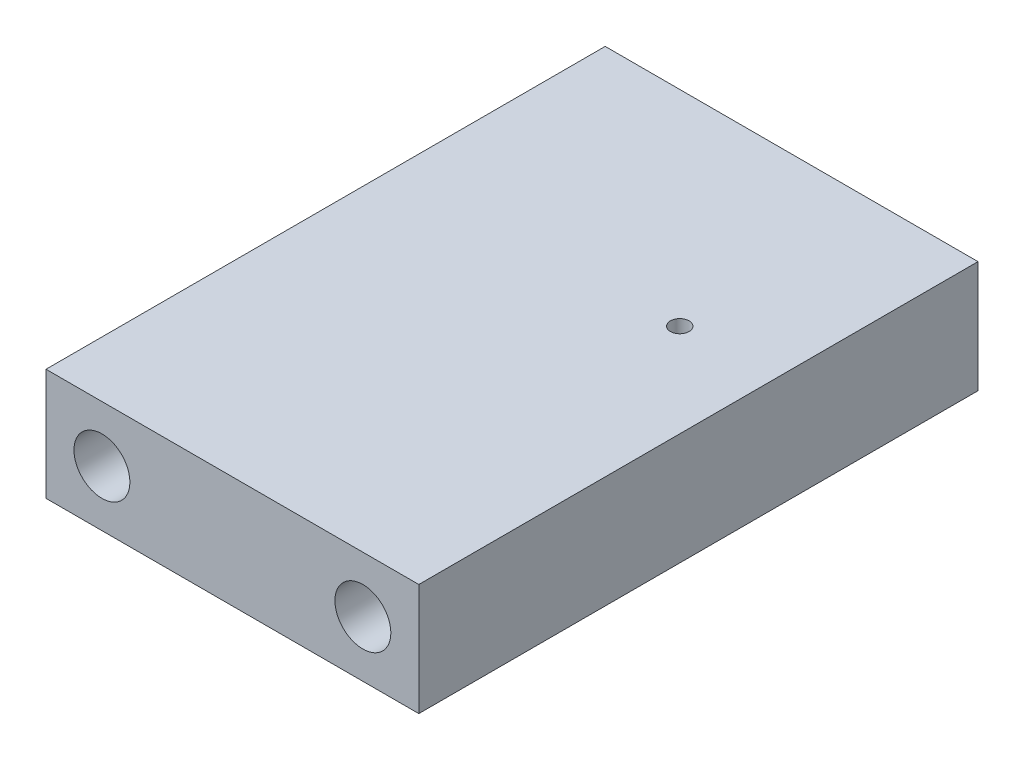
ISO-10303-21;
HEADER;
FILE_DESCRIPTION(('STEP AP214'),'2;1');
FILE_NAME('part.step','',(''),(''),'','','');
FILE_SCHEMA(('AUTOMOTIVE_DESIGN { 1 0 10303 214 1 1 1 1 }'));
ENDSEC;
DATA;
#1=APPLICATION_CONTEXT('core data for automotive mechanical design processes');
#2=APPLICATION_PROTOCOL_DEFINITION('international standard','automotive_design',2000,#1);
#3=PRODUCT_CONTEXT('',#1,'mechanical');
#4=PRODUCT('Part','Part','',(#3));
#5=PRODUCT_RELATED_PRODUCT_CATEGORY('part','',(#4));
#6=PRODUCT_DEFINITION_FORMATION('','',#4);
#7=PRODUCT_DEFINITION_CONTEXT('part definition',#1,'design');
#8=PRODUCT_DEFINITION('design','',#6,#7);
#9=PRODUCT_DEFINITION_SHAPE('','',#8);
#10=(LENGTH_UNIT() NAMED_UNIT(*) SI_UNIT(.MILLI.,.METRE.));
#11=(NAMED_UNIT(*) PLANE_ANGLE_UNIT() SI_UNIT($,.RADIAN.));
#12=(NAMED_UNIT(*) SI_UNIT($,.STERADIAN.) SOLID_ANGLE_UNIT());
#13=UNCERTAINTY_MEASURE_WITH_UNIT(LENGTH_MEASURE(1.E-05),#10,'distance_accuracy_value','');
#14=(GEOMETRIC_REPRESENTATION_CONTEXT(3) GLOBAL_UNCERTAINTY_ASSIGNED_CONTEXT((#13)) GLOBAL_UNIT_ASSIGNED_CONTEXT((#10,
#11,#12)) REPRESENTATION_CONTEXT('',''));
#15=CARTESIAN_POINT('',(0.,0.,0.));
#16=DIRECTION('',(0.,0.,1.));
#17=DIRECTION('',(1.,0.,0.));
#18=AXIS2_PLACEMENT_3D('',#15,#16,#17);
#19=CARTESIAN_POINT('',(0.,0.,30.));
#20=DIRECTION('',(1.,0.,0.));
#21=DIRECTION('',(0.,0.,-1.));
#22=AXIS2_PLACEMENT_3D('',#19,#20,#21);
#23=PLANE('',#22);
#24=DIRECTION('',(0.,-1.,0.));
#25=VECTOR('',#24,1.);
#26=CARTESIAN_POINT('',(0.,0.,0.));
#27=LINE('',#26,#25);
#28=CARTESIAN_POINT('',(0.,6.,0.));
#29=VERTEX_POINT('',#28);
#30=CARTESIAN_POINT('',(0.,0.,0.));
#31=VERTEX_POINT('',#30);
#32=EDGE_CURVE('E95',#29,#31,#27,.T.);
#33=ORIENTED_EDGE('',*,*,#32,.T.);
#34=DIRECTION('',(0.,0.,-1.));
#35=VECTOR('',#34,1.);
#36=CARTESIAN_POINT('',(0.,0.,30.));
#37=LINE('',#36,#35);
#38=CARTESIAN_POINT('',(0.,0.,30.));
#39=VERTEX_POINT('',#38);
#40=EDGE_CURVE('E11',#39,#31,#37,.T.);
#41=ORIENTED_EDGE('',*,*,#40,.F.);
#42=DIRECTION('',(0.,-1.,0.));
#43=VECTOR('',#42,1.);
#44=CARTESIAN_POINT('',(0.,0.,30.));
#45=LINE('',#44,#43);
#46=CARTESIAN_POINT('',(0.,6.,30.));
#47=VERTEX_POINT('',#46);
#48=EDGE_CURVE('E83',#47,#39,#45,.T.);
#49=ORIENTED_EDGE('',*,*,#48,.F.);
#50=DIRECTION('',(0.,0.,-1.));
#51=VECTOR('',#50,1.);
#52=CARTESIAN_POINT('',(0.,6.,30.));
#53=LINE('',#52,#51);
#54=EDGE_CURVE('E91',#47,#29,#53,.T.);
#55=ORIENTED_EDGE('',*,*,#54,.T.);
#56=EDGE_LOOP('',(#33,#41,#49,#55));
#57=FACE_BOUND('',#56,.T.);
#58=ADVANCED_FACE('F32',(#57),#23,.F.);
#59=CARTESIAN_POINT('',(0.,0.,30.));
#60=DIRECTION('',(0.,1.,0.));
#61=DIRECTION('',(0.,0.,1.));
#62=AXIS2_PLACEMENT_3D('',#59,#60,#61);
#63=PLANE('',#62);
#64=CARTESIAN_POINT('',(15.,0.,11.));
#65=DIRECTION('',(0.,1.,0.));
#66=DIRECTION('',(0.,0.,1.));
#67=AXIS2_PLACEMENT_3D('',#64,#65,#66);
#68=CIRCLE('',#67,0.500000000000001);
#69=CARTESIAN_POINT('',(15.,0.,11.5));
#70=VERTEX_POINT('',#69);
#71=EDGE_CURVE('E130',#70,#70,#68,.T.);
#72=ORIENTED_EDGE('',*,*,#71,.T.);
#73=EDGE_LOOP('',(#72));
#74=FACE_BOUND('',#73,.T.);
#75=DIRECTION('',(1.,0.,0.));
#76=VECTOR('',#75,1.);
#77=CARTESIAN_POINT('',(0.,0.,0.));
#78=LINE('',#77,#76);
#79=CARTESIAN_POINT('',(20.,0.,0.));
#80=VERTEX_POINT('',#79);
#81=EDGE_CURVE('E87',#31,#80,#78,.T.);
#82=ORIENTED_EDGE('',*,*,#81,.T.);
#83=DIRECTION('',(0.,0.,-1.));
#84=VECTOR('',#83,1.);
#85=CARTESIAN_POINT('',(20.,0.,30.));
#86=LINE('',#85,#84);
#87=CARTESIAN_POINT('',(20.,0.,30.));
#88=VERTEX_POINT('',#87);
#89=EDGE_CURVE('E40',#88,#80,#86,.T.);
#90=ORIENTED_EDGE('',*,*,#89,.F.);
#91=DIRECTION('',(1.,0.,0.));
#92=VECTOR('',#91,1.);
#93=CARTESIAN_POINT('',(0.,0.,30.));
#94=LINE('',#93,#92);
#95=EDGE_CURVE('E78',#39,#88,#94,.T.);
#96=ORIENTED_EDGE('',*,*,#95,.F.);
#97=ORIENTED_EDGE('',*,*,#40,.T.);
#98=EDGE_LOOP('',(#82,#90,#96,#97));
#99=FACE_BOUND('',#98,.T.);
#100=ADVANCED_FACE('F86',(#74,#99),#63,.F.);
#101=CARTESIAN_POINT('',(20.,0.,30.));
#102=DIRECTION('',(-1.,0.,0.));
#103=DIRECTION('',(0.,0.,1.));
#104=AXIS2_PLACEMENT_3D('',#101,#102,#103);
#105=PLANE('',#104);
#106=DIRECTION('',(0.,1.,0.));
#107=VECTOR('',#106,1.);
#108=CARTESIAN_POINT('',(20.,0.,0.));
#109=LINE('',#108,#107);
#110=CARTESIAN_POINT('',(20.,6.,0.));
#111=VERTEX_POINT('',#110);
#112=EDGE_CURVE('E65',#80,#111,#109,.T.);
#113=ORIENTED_EDGE('',*,*,#112,.T.);
#114=DIRECTION('',(0.,0.,-1.));
#115=VECTOR('',#114,1.);
#116=CARTESIAN_POINT('',(20.,6.,30.));
#117=LINE('',#116,#115);
#118=CARTESIAN_POINT('',(20.,6.,30.));
#119=VERTEX_POINT('',#118);
#120=EDGE_CURVE('E88',#119,#111,#117,.T.);
#121=ORIENTED_EDGE('',*,*,#120,.F.);
#122=DIRECTION('',(0.,1.,0.));
#123=VECTOR('',#122,1.);
#124=CARTESIAN_POINT('',(20.,0.,30.));
#125=LINE('',#124,#123);
#126=EDGE_CURVE('E81',#88,#119,#125,.T.);
#127=ORIENTED_EDGE('',*,*,#126,.F.);
#128=ORIENTED_EDGE('',*,*,#89,.T.);
#129=EDGE_LOOP('',(#113,#121,#127,#128));
#130=FACE_BOUND('',#129,.T.);
#131=ADVANCED_FACE('F89',(#130),#105,.F.);
#132=CARTESIAN_POINT('',(0.,6.,30.));
#133=DIRECTION('',(0.,-1.,0.));
#134=DIRECTION('',(0.,0.,-1.));
#135=AXIS2_PLACEMENT_3D('',#132,#133,#134);
#136=PLANE('',#135);
#137=CARTESIAN_POINT('',(15.,6.,11.));
#138=DIRECTION('',(0.,1.,0.));
#139=DIRECTION('',(0.,0.,1.));
#140=AXIS2_PLACEMENT_3D('',#137,#138,#139);
#141=CIRCLE('',#140,0.500000000000001);
#142=CARTESIAN_POINT('',(15.,6.,11.5));
#143=VERTEX_POINT('',#142);
#144=EDGE_CURVE('E135',#143,#143,#141,.T.);
#145=ORIENTED_EDGE('',*,*,#144,.F.);
#146=EDGE_LOOP('',(#145));
#147=FACE_BOUND('',#146,.T.);
#148=DIRECTION('',(-1.,0.,0.));
#149=VECTOR('',#148,1.);
#150=CARTESIAN_POINT('',(0.,6.,0.));
#151=LINE('',#150,#149);
#152=EDGE_CURVE('E71',#111,#29,#151,.T.);
#153=ORIENTED_EDGE('',*,*,#152,.T.);
#154=ORIENTED_EDGE('',*,*,#54,.F.);
#155=DIRECTION('',(-1.,0.,0.));
#156=VECTOR('',#155,1.);
#157=CARTESIAN_POINT('',(0.,6.,30.));
#158=LINE('',#157,#156);
#159=EDGE_CURVE('E48',#119,#47,#158,.T.);
#160=ORIENTED_EDGE('',*,*,#159,.F.);
#161=ORIENTED_EDGE('',*,*,#120,.T.);
#162=EDGE_LOOP('',(#153,#154,#160,#161));
#163=FACE_BOUND('',#162,.T.);
#164=ADVANCED_FACE('F103',(#147,#163),#136,.F.);
#165=CARTESIAN_POINT('',(0.,0.,30.));
#166=DIRECTION('',(0.,0.,-1.));
#167=DIRECTION('',(-1.,0.,0.));
#168=AXIS2_PLACEMENT_3D('',#165,#166,#167);
#169=PLANE('',#168);
#170=CARTESIAN_POINT('',(17.,3.,30.));
#171=DIRECTION('',(0.,0.,1.));
#172=DIRECTION('',(1.,0.,0.));
#173=AXIS2_PLACEMENT_3D('',#170,#171,#172);
#174=CIRCLE('',#173,1.5);
#175=CARTESIAN_POINT('',(18.5,3.,30.));
#176=VERTEX_POINT('',#175);
#177=EDGE_CURVE('E115',#176,#176,#174,.T.);
#178=ORIENTED_EDGE('',*,*,#177,.F.);
#179=EDGE_LOOP('',(#178));
#180=FACE_BOUND('',#179,.T.);
#181=CARTESIAN_POINT('',(3.,3.,30.));
#182=DIRECTION('',(0.,0.,1.));
#183=DIRECTION('',(1.,0.,0.));
#184=AXIS2_PLACEMENT_3D('',#181,#182,#183);
#185=CIRCLE('',#184,1.5);
#186=CARTESIAN_POINT('',(4.5,3.,30.));
#187=VERTEX_POINT('',#186);
#188=EDGE_CURVE('E109',#187,#187,#185,.T.);
#189=ORIENTED_EDGE('',*,*,#188,.F.);
#190=EDGE_LOOP('',(#189));
#191=FACE_BOUND('',#190,.T.);
#192=ORIENTED_EDGE('',*,*,#48,.T.);
#193=ORIENTED_EDGE('',*,*,#95,.T.);
#194=ORIENTED_EDGE('',*,*,#126,.T.);
#195=ORIENTED_EDGE('',*,*,#159,.T.);
#196=EDGE_LOOP('',(#192,#193,#194,#195));
#197=FACE_BOUND('',#196,.T.);
#198=ADVANCED_FACE('F79',(#180,#191,#197),#169,.F.);
#199=CARTESIAN_POINT('',(0.,0.,0.));
#200=DIRECTION('',(0.,0.,-1.));
#201=DIRECTION('',(-1.,0.,0.));
#202=AXIS2_PLACEMENT_3D('',#199,#200,#201);
#203=PLANE('',#202);
#204=CARTESIAN_POINT('',(3.,3.,0.));
#205=DIRECTION('',(0.,0.,-1.));
#206=DIRECTION('',(-1.,0.,0.));
#207=AXIS2_PLACEMENT_3D('',#204,#205,#206);
#208=CIRCLE('',#207,1.5);
#209=CARTESIAN_POINT('',(1.5,3.,0.));
#210=VERTEX_POINT('',#209);
#211=EDGE_CURVE('E127',#210,#210,#208,.T.);
#212=ORIENTED_EDGE('',*,*,#211,.F.);
#213=EDGE_LOOP('',(#212));
#214=FACE_BOUND('',#213,.T.);
#215=CARTESIAN_POINT('',(17.,3.,0.));
#216=DIRECTION('',(0.,0.,-1.));
#217=DIRECTION('',(-1.,0.,0.));
#218=AXIS2_PLACEMENT_3D('',#215,#216,#217);
#219=CIRCLE('',#218,1.5);
#220=CARTESIAN_POINT('',(15.5,3.,0.));
#221=VERTEX_POINT('',#220);
#222=EDGE_CURVE('E121',#221,#221,#219,.T.);
#223=ORIENTED_EDGE('',*,*,#222,.F.);
#224=EDGE_LOOP('',(#223));
#225=FACE_BOUND('',#224,.T.);
#226=ORIENTED_EDGE('',*,*,#32,.F.);
#227=ORIENTED_EDGE('',*,*,#152,.F.);
#228=ORIENTED_EDGE('',*,*,#112,.F.);
#229=ORIENTED_EDGE('',*,*,#81,.F.);
#230=EDGE_LOOP('',(#226,#227,#228,#229));
#231=FACE_BOUND('',#230,.T.);
#232=ADVANCED_FACE('F106',(#214,#225,#231),#203,.T.);
#233=CARTESIAN_POINT('',(3.,3.,25.));
#234=DIRECTION('',(0.,0.,1.));
#235=DIRECTION('',(1.,0.,0.));
#236=AXIS2_PLACEMENT_3D('',#233,#234,#235);
#237=CYLINDRICAL_SURFACE('',#236,1.5);
#238=CARTESIAN_POINT('',(3.,3.,25.));
#239=DIRECTION('',(0.,0.,1.));
#240=DIRECTION('',(1.,0.,0.));
#241=AXIS2_PLACEMENT_3D('',#238,#239,#240);
#242=CIRCLE('',#241,1.5);
#243=CARTESIAN_POINT('',(4.5,3.,25.));
#244=VERTEX_POINT('',#243);
#245=EDGE_CURVE('E98',#244,#244,#242,.T.);
#246=ORIENTED_EDGE('',*,*,#245,.F.);
#247=EDGE_LOOP('',(#246));
#248=FACE_BOUND('',#247,.T.);
#249=ORIENTED_EDGE('',*,*,#188,.T.);
#250=EDGE_LOOP('',(#249));
#251=FACE_BOUND('',#250,.T.);
#252=ADVANCED_FACE('F192',(#248,#251),#237,.F.);
#253=CARTESIAN_POINT('',(3.,3.,25.));
#254=DIRECTION('',(0.,0.,1.));
#255=DIRECTION('',(1.,0.,0.));
#256=AXIS2_PLACEMENT_3D('',#253,#254,#255);
#257=PLANE('',#256);
#258=ORIENTED_EDGE('',*,*,#245,.T.);
#259=EDGE_LOOP('',(#258));
#260=FACE_BOUND('',#259,.T.);
#261=ADVANCED_FACE('F188',(#260),#257,.T.);
#262=CARTESIAN_POINT('',(17.,3.,25.));
#263=DIRECTION('',(0.,0.,1.));
#264=DIRECTION('',(1.,0.,0.));
#265=AXIS2_PLACEMENT_3D('',#262,#263,#264);
#266=CYLINDRICAL_SURFACE('',#265,1.5);
#267=CARTESIAN_POINT('',(17.,3.,25.));
#268=DIRECTION('',(0.,0.,1.));
#269=DIRECTION('',(1.,0.,0.));
#270=AXIS2_PLACEMENT_3D('',#267,#268,#269);
#271=CIRCLE('',#270,1.5);
#272=CARTESIAN_POINT('',(18.5,3.,25.));
#273=VERTEX_POINT('',#272);
#274=EDGE_CURVE('E112',#273,#273,#271,.T.);
#275=ORIENTED_EDGE('',*,*,#274,.F.);
#276=EDGE_LOOP('',(#275));
#277=FACE_BOUND('',#276,.T.);
#278=ORIENTED_EDGE('',*,*,#177,.T.);
#279=EDGE_LOOP('',(#278));
#280=FACE_BOUND('',#279,.T.);
#281=ADVANCED_FACE('F184',(#277,#280),#266,.F.);
#282=CARTESIAN_POINT('',(17.,3.,25.));
#283=DIRECTION('',(0.,0.,1.));
#284=DIRECTION('',(1.,0.,0.));
#285=AXIS2_PLACEMENT_3D('',#282,#283,#284);
#286=PLANE('',#285);
#287=ORIENTED_EDGE('',*,*,#274,.T.);
#288=EDGE_LOOP('',(#287));
#289=FACE_BOUND('',#288,.T.);
#290=ADVANCED_FACE('F180',(#289),#286,.T.);
#291=CARTESIAN_POINT('',(17.,3.,5.));
#292=DIRECTION('',(0.,0.,-1.));
#293=DIRECTION('',(-1.,0.,0.));
#294=AXIS2_PLACEMENT_3D('',#291,#292,#293);
#295=CYLINDRICAL_SURFACE('',#294,1.5);
#296=CARTESIAN_POINT('',(17.,3.,5.));
#297=DIRECTION('',(0.,0.,-1.));
#298=DIRECTION('',(-1.,0.,0.));
#299=AXIS2_PLACEMENT_3D('',#296,#297,#298);
#300=CIRCLE('',#299,1.5);
#301=CARTESIAN_POINT('',(15.5,3.,5.));
#302=VERTEX_POINT('',#301);
#303=EDGE_CURVE('E118',#302,#302,#300,.T.);
#304=ORIENTED_EDGE('',*,*,#303,.F.);
#305=EDGE_LOOP('',(#304));
#306=FACE_BOUND('',#305,.T.);
#307=ORIENTED_EDGE('',*,*,#222,.T.);
#308=EDGE_LOOP('',(#307));
#309=FACE_BOUND('',#308,.T.);
#310=ADVANCED_FACE('F176',(#306,#309),#295,.F.);
#311=CARTESIAN_POINT('',(17.,3.,5.));
#312=DIRECTION('',(0.,0.,-1.));
#313=DIRECTION('',(-1.,0.,0.));
#314=AXIS2_PLACEMENT_3D('',#311,#312,#313);
#315=PLANE('',#314);
#316=ORIENTED_EDGE('',*,*,#303,.T.);
#317=EDGE_LOOP('',(#316));
#318=FACE_BOUND('',#317,.T.);
#319=ADVANCED_FACE('F172',(#318),#315,.T.);
#320=CARTESIAN_POINT('',(3.,3.,5.));
#321=DIRECTION('',(0.,0.,-1.));
#322=DIRECTION('',(-1.,0.,0.));
#323=AXIS2_PLACEMENT_3D('',#320,#321,#322);
#324=CYLINDRICAL_SURFACE('',#323,1.5);
#325=CARTESIAN_POINT('',(3.,3.,5.));
#326=DIRECTION('',(0.,0.,-1.));
#327=DIRECTION('',(-1.,0.,0.));
#328=AXIS2_PLACEMENT_3D('',#325,#326,#327);
#329=CIRCLE('',#328,1.5);
#330=CARTESIAN_POINT('',(1.5,3.,5.));
#331=VERTEX_POINT('',#330);
#332=EDGE_CURVE('E124',#331,#331,#329,.T.);
#333=ORIENTED_EDGE('',*,*,#332,.F.);
#334=EDGE_LOOP('',(#333));
#335=FACE_BOUND('',#334,.T.);
#336=ORIENTED_EDGE('',*,*,#211,.T.);
#337=EDGE_LOOP('',(#336));
#338=FACE_BOUND('',#337,.T.);
#339=ADVANCED_FACE('F166',(#335,#338),#324,.F.);
#340=CARTESIAN_POINT('',(3.,3.,5.));
#341=DIRECTION('',(0.,0.,-1.));
#342=DIRECTION('',(-1.,0.,0.));
#343=AXIS2_PLACEMENT_3D('',#340,#341,#342);
#344=PLANE('',#343);
#345=ORIENTED_EDGE('',*,*,#332,.T.);
#346=EDGE_LOOP('',(#345));
#347=FACE_BOUND('',#346,.T.);
#348=ADVANCED_FACE('F161',(#347),#344,.T.);
#349=CARTESIAN_POINT('',(15.,-4.,11.));
#350=DIRECTION('',(0.,1.,0.));
#351=DIRECTION('',(0.,0.,1.));
#352=AXIS2_PLACEMENT_3D('',#349,#350,#351);
#353=CYLINDRICAL_SURFACE('',#352,0.500000000000001);
#354=ORIENTED_EDGE('',*,*,#144,.T.);
#355=EDGE_LOOP('',(#354));
#356=FACE_BOUND('',#355,.T.);
#357=ORIENTED_EDGE('',*,*,#71,.F.);
#358=EDGE_LOOP('',(#357));
#359=FACE_BOUND('',#358,.T.);
#360=ADVANCED_FACE('F139',(#356,#359),#353,.F.);
#361=CLOSED_SHELL('',(#58,#100,#131,#164,#198,#232,#252,#261,#281,#290,#310,#319,#339,#348,#360));
#362=MANIFOLD_SOLID_BREP('B2',#361);
#363=ADVANCED_BREP_SHAPE_REPRESENTATION('',(#18,#362),#14);
#364=SHAPE_DEFINITION_REPRESENTATION(#9,#363);
ENDSEC;
END-ISO-10303-21;
